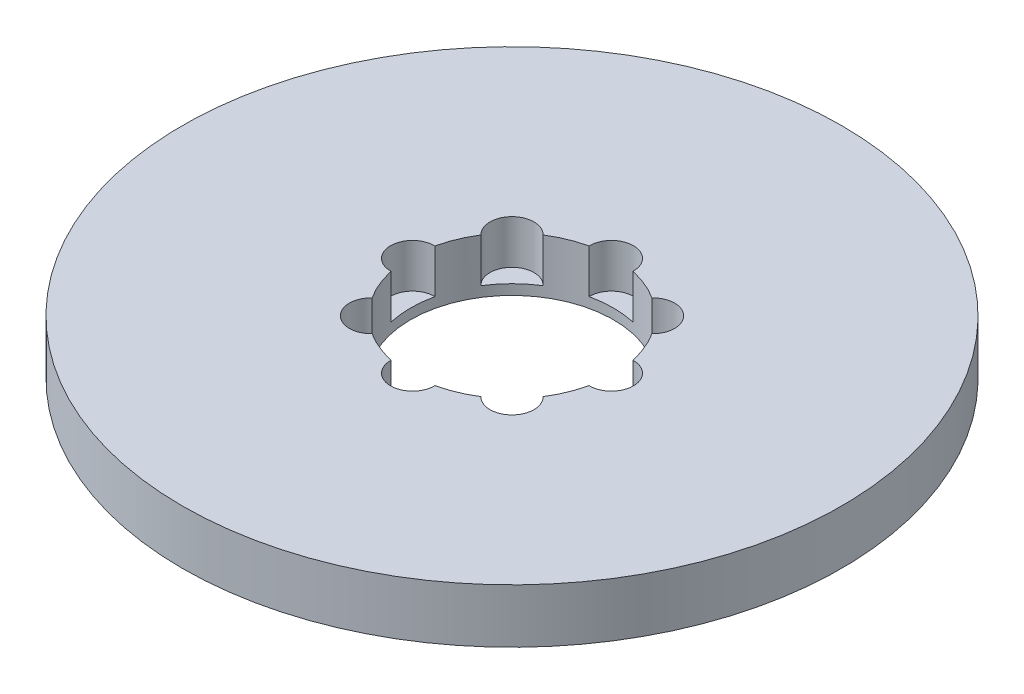
ISO-10303-21;
HEADER;
FILE_DESCRIPTION(('STEP AP214'),'2;1');
FILE_NAME('part.step','',(''),(''),'','','');
FILE_SCHEMA(('AUTOMOTIVE_DESIGN { 1 0 10303 214 1 1 1 1 }'));
ENDSEC;
DATA;
#1=APPLICATION_CONTEXT('core data for automotive mechanical design processes');
#2=APPLICATION_PROTOCOL_DEFINITION('international standard','automotive_design',2000,#1);
#3=PRODUCT_CONTEXT('',#1,'mechanical');
#4=PRODUCT('Part','Part','',(#3));
#5=PRODUCT_RELATED_PRODUCT_CATEGORY('part','',(#4));
#6=PRODUCT_DEFINITION_FORMATION('','',#4);
#7=PRODUCT_DEFINITION_CONTEXT('part definition',#1,'design');
#8=PRODUCT_DEFINITION('design','',#6,#7);
#9=PRODUCT_DEFINITION_SHAPE('','',#8);
#10=(LENGTH_UNIT() NAMED_UNIT(*) SI_UNIT(.MILLI.,.METRE.));
#11=(NAMED_UNIT(*) PLANE_ANGLE_UNIT() SI_UNIT($,.RADIAN.));
#12=(NAMED_UNIT(*) SI_UNIT($,.STERADIAN.) SOLID_ANGLE_UNIT());
#13=UNCERTAINTY_MEASURE_WITH_UNIT(LENGTH_MEASURE(1.E-05),#10,'distance_accuracy_value','');
#14=(GEOMETRIC_REPRESENTATION_CONTEXT(3) GLOBAL_UNCERTAINTY_ASSIGNED_CONTEXT((#13)) GLOBAL_UNIT_ASSIGNED_CONTEXT((#10,
#11,#12)) REPRESENTATION_CONTEXT('',''));
#15=CARTESIAN_POINT('',(0.,0.,0.));
#16=DIRECTION('',(0.,0.,1.));
#17=DIRECTION('',(1.,0.,0.));
#18=AXIS2_PLACEMENT_3D('',#15,#16,#17);
#19=CARTESIAN_POINT('',(0.,16.,0.));
#20=DIRECTION('',(0.,-1.,0.));
#21=DIRECTION('',(0.,0.,-1.));
#22=AXIS2_PLACEMENT_3D('',#19,#20,#21);
#23=CYLINDRICAL_SURFACE('',#22,97.5);
#24=CARTESIAN_POINT('',(0.,16.,0.));
#25=DIRECTION('',(0.,1.,0.));
#26=DIRECTION('',(0.,0.,1.));
#27=AXIS2_PLACEMENT_3D('',#24,#25,#26);
#28=CIRCLE('',#27,97.5);
#29=CARTESIAN_POINT('',(0.,16.,97.5));
#30=VERTEX_POINT('',#29);
#31=EDGE_CURVE('E195',#30,#30,#28,.T.);
#32=ORIENTED_EDGE('',*,*,#31,.F.);
#33=EDGE_LOOP('',(#32));
#34=FACE_BOUND('',#33,.T.);
#35=CARTESIAN_POINT('',(0.,0.,0.));
#36=DIRECTION('',(0.,1.,0.));
#37=DIRECTION('',(0.,0.,1.));
#38=AXIS2_PLACEMENT_3D('',#35,#36,#37);
#39=CIRCLE('',#38,97.5);
#40=CARTESIAN_POINT('',(0.,0.,97.5));
#41=VERTEX_POINT('',#40);
#42=EDGE_CURVE('E179',#41,#41,#39,.T.);
#43=ORIENTED_EDGE('',*,*,#42,.T.);
#44=EDGE_LOOP('',(#43));
#45=FACE_BOUND('',#44,.T.);
#46=ADVANCED_FACE('F39',(#34,#45),#23,.T.);
#47=CARTESIAN_POINT('',(0.,16.,0.));
#48=DIRECTION('',(0.,1.,0.));
#49=DIRECTION('',(0.,0.,1.));
#50=AXIS2_PLACEMENT_3D('',#47,#48,#49);
#51=PLANE('',#50);
#52=CARTESIAN_POINT('',(1.02750242661465E-13,16.,29.4288391343688));
#53=DIRECTION('',(0.,1.,0.));
#54=DIRECTION('',(1.,0.,0.));
#55=AXIS2_PLACEMENT_3D('',#52,#53,#54);
#56=CIRCLE('',#55,6.49763676903849);
#57=CARTESIAN_POINT('',(-6.49611522311852,16.,29.2882312031295));
#58=VERTEX_POINT('',#57);
#59=CARTESIAN_POINT('',(6.49611522311872,16.,29.2882312031294));
#60=VERTEX_POINT('',#59);
#61=EDGE_CURVE('E176',#58,#60,#56,.T.);
#62=ORIENTED_EDGE('',*,*,#61,.F.);
#63=CARTESIAN_POINT('',(0.,16.,0.));
#64=DIRECTION('',(0.,1.,0.));
#65=DIRECTION('',(0.,0.,1.));
#66=AXIS2_PLACEMENT_3D('',#63,#64,#65);
#67=CIRCLE('',#66,30.);
#68=CARTESIAN_POINT('',(-16.1164597670559,16.,25.3033540183286));
#69=VERTEX_POINT('',#68);
#70=EDGE_CURVE('E166',#69,#58,#67,.T.);
#71=ORIENTED_EDGE('',*,*,#70,.F.);
#72=CARTESIAN_POINT('',(-20.8093317143602,16.,20.8093317143602));
#73=DIRECTION('',(0.,1.,0.));
#74=DIRECTION('',(0.707106781186549,0.,0.707106781186546));
#75=AXIS2_PLACEMENT_3D('',#72,#73,#74);
#76=CIRCLE('',#75,6.49763676903849);
#77=CARTESIAN_POINT('',(-25.3033540183286,16.,16.116459767056));
#78=VERTEX_POINT('',#77);
#79=EDGE_CURVE('E147',#78,#69,#76,.T.);
#80=ORIENTED_EDGE('',*,*,#79,.F.);
#81=CARTESIAN_POINT('',(-29.2882312031295,16.,6.49611522311862));
#82=VERTEX_POINT('',#81);
#83=EDGE_CURVE('E180',#82,#78,#67,.T.);
#84=ORIENTED_EDGE('',*,*,#83,.F.);
#85=CARTESIAN_POINT('',(-29.4288391343688,16.,0.));
#86=DIRECTION('',(0.,1.,0.));
#87=DIRECTION('',(0.,0.,1.));
#88=AXIS2_PLACEMENT_3D('',#85,#86,#87);
#89=CIRCLE('',#88,6.49763676903849);
#90=CARTESIAN_POINT('',(-29.2882312031295,16.,-6.49611522311862));
#91=VERTEX_POINT('',#90);
#92=EDGE_CURVE('E186',#91,#82,#89,.T.);
#93=ORIENTED_EDGE('',*,*,#92,.F.);
#94=CARTESIAN_POINT('',(-25.3033540183288,16.,-16.1164597670556));
#95=VERTEX_POINT('',#94);
#96=EDGE_CURVE('E182',#95,#91,#67,.T.);
#97=ORIENTED_EDGE('',*,*,#96,.F.);
#98=CARTESIAN_POINT('',(-20.8093317143605,16.,-20.8093317143599));
#99=DIRECTION('',(0.,1.,0.));
#100=DIRECTION('',(-0.707106781186539,0.,0.707106781186556));
#101=AXIS2_PLACEMENT_3D('',#98,#99,#100);
#102=CIRCLE('',#101,6.49763676903849);
#103=CARTESIAN_POINT('',(-16.1164597670562,16.,-25.3033540183284));
#104=VERTEX_POINT('',#103);
#105=EDGE_CURVE('E446',#104,#95,#102,.T.);
#106=ORIENTED_EDGE('',*,*,#105,.F.);
#107=CARTESIAN_POINT('',(-6.49611522311893,16.,-29.2882312031294));
#108=VERTEX_POINT('',#107);
#109=EDGE_CURVE('E452',#108,#104,#67,.T.);
#110=ORIENTED_EDGE('',*,*,#109,.F.);
#111=CARTESIAN_POINT('',(-3.08250727984395E-13,16.,-29.4288391343688));
#112=DIRECTION('',(0.,1.,0.));
#113=DIRECTION('',(-1.,0.,0.));
#114=AXIS2_PLACEMENT_3D('',#111,#112,#113);
#115=CIRCLE('',#114,6.49763676903849);
#116=CARTESIAN_POINT('',(6.49611522311832,16.,-29.2882312031295));
#117=VERTEX_POINT('',#116);
#118=EDGE_CURVE('E477',#117,#108,#115,.T.);
#119=ORIENTED_EDGE('',*,*,#118,.F.);
#120=CARTESIAN_POINT('',(16.1164597670557,16.,-25.3033540183288));
#121=VERTEX_POINT('',#120);
#122=EDGE_CURVE('E460',#121,#117,#67,.T.);
#123=ORIENTED_EDGE('',*,*,#122,.F.);
#124=CARTESIAN_POINT('',(20.80933171436,16.,-20.8093317143604));
#125=DIRECTION('',(0.,1.,0.));
#126=DIRECTION('',(-0.707106781186554,0.,-0.707106781186541));
#127=AXIS2_PLACEMENT_3D('',#124,#125,#126);
#128=CIRCLE('',#127,6.49763676903849);
#129=CARTESIAN_POINT('',(25.3033540183285,16.,-16.1164597670562));
#130=VERTEX_POINT('',#129);
#131=EDGE_CURVE('E464',#130,#121,#128,.T.);
#132=ORIENTED_EDGE('',*,*,#131,.F.);
#133=CARTESIAN_POINT('',(29.2882312031295,16.,-6.49611522311862));
#134=VERTEX_POINT('',#133);
#135=EDGE_CURVE('E459',#134,#130,#67,.T.);
#136=ORIENTED_EDGE('',*,*,#135,.F.);
#137=CARTESIAN_POINT('',(29.4288391343688,16.,0.));
#138=DIRECTION('',(0.,1.,0.));
#139=DIRECTION('',(0.,0.,-1.));
#140=AXIS2_PLACEMENT_3D('',#137,#138,#139);
#141=CIRCLE('',#140,6.49763676903849);
#142=CARTESIAN_POINT('',(29.2882312031295,16.,6.49611522311862));
#143=VERTEX_POINT('',#142);
#144=EDGE_CURVE('E469',#143,#134,#141,.T.);
#145=ORIENTED_EDGE('',*,*,#144,.F.);
#146=CARTESIAN_POINT('',(25.3033540183287,16.,16.1164597670558));
#147=VERTEX_POINT('',#146);
#148=EDGE_CURVE('E181',#147,#143,#67,.T.);
#149=ORIENTED_EDGE('',*,*,#148,.F.);
#150=CARTESIAN_POINT('',(20.8093317143603,16.,20.8093317143601));
#151=DIRECTION('',(0.,1.,0.));
#152=DIRECTION('',(0.707106781186544,0.,-0.707106781186551));
#153=AXIS2_PLACEMENT_3D('',#150,#151,#152);
#154=CIRCLE('',#153,6.49763676903849);
#155=CARTESIAN_POINT('',(16.1164597670561,16.,25.3033540183285));
#156=VERTEX_POINT('',#155);
#157=EDGE_CURVE('E475',#156,#147,#154,.T.);
#158=ORIENTED_EDGE('',*,*,#157,.F.);
#159=EDGE_CURVE('E177',#60,#156,#67,.T.);
#160=ORIENTED_EDGE('',*,*,#159,.F.);
#161=EDGE_LOOP('',(#62,#71,#80,#84,#93,#97,#106,#110,#119,#123,#132,#136,#145,#149,#158,#160));
#162=FACE_BOUND('',#161,.T.);
#163=ORIENTED_EDGE('',*,*,#31,.T.);
#164=EDGE_LOOP('',(#163));
#165=FACE_BOUND('',#164,.T.);
#166=ADVANCED_FACE('F172',(#162,#165),#51,.T.);
#167=CARTESIAN_POINT('',(0.,0.,0.));
#168=DIRECTION('',(0.,1.,0.));
#169=DIRECTION('',(0.,0.,1.));
#170=AXIS2_PLACEMENT_3D('',#167,#168,#169);
#171=PLANE('',#170);
#172=CARTESIAN_POINT('',(0.,0.,0.));
#173=DIRECTION('',(0.,1.,0.));
#174=DIRECTION('',(0.,0.,1.));
#175=AXIS2_PLACEMENT_3D('',#172,#173,#174);
#176=CIRCLE('',#175,30.);
#177=CARTESIAN_POINT('',(0.,0.,30.));
#178=VERTEX_POINT('',#177);
#179=EDGE_CURVE('E187',#178,#178,#176,.T.);
#180=ORIENTED_EDGE('',*,*,#179,.T.);
#181=EDGE_LOOP('',(#180));
#182=FACE_BOUND('',#181,.T.);
#183=ORIENTED_EDGE('',*,*,#42,.F.);
#184=EDGE_LOOP('',(#183));
#185=FACE_BOUND('',#184,.T.);
#186=ADVANCED_FACE('F270',(#182,#185),#171,.F.);
#187=CARTESIAN_POINT('',(0.,16.,0.));
#188=DIRECTION('',(0.,-1.,0.));
#189=DIRECTION('',(0.,0.,-1.));
#190=AXIS2_PLACEMENT_3D('',#187,#188,#189);
#191=CYLINDRICAL_SURFACE('',#190,30.);
#192=DIRECTION('',(0.,1.,0.));
#193=VECTOR('',#192,1.);
#194=CARTESIAN_POINT('',(-6.49611522311852,9.50740848919662,29.2882312031295));
#195=LINE('',#194,#193);
#196=CARTESIAN_POINT('',(-6.49611522311852,3.01481697839323,29.2882312031295));
#197=VERTEX_POINT('',#196);
#198=EDGE_CURVE('E11',#197,#58,#195,.T.);
#199=ORIENTED_EDGE('',*,*,#198,.F.);
#200=CARTESIAN_POINT('',(0.,3.01481697839323,0.));
#201=DIRECTION('',(0.,1.,0.));
#202=DIRECTION('',(0.,0.,1.));
#203=AXIS2_PLACEMENT_3D('',#200,#201,#202);
#204=CIRCLE('',#203,30.);
#205=CARTESIAN_POINT('',(6.49611522311872,3.01481697839323,29.2882312031294));
#206=VERTEX_POINT('',#205);
#207=EDGE_CURVE('E250',#197,#206,#204,.T.);
#208=ORIENTED_EDGE('',*,*,#207,.T.);
#209=DIRECTION('',(0.,1.,0.));
#210=VECTOR('',#209,1.);
#211=CARTESIAN_POINT('',(6.49611522311872,9.50740848919662,29.2882312031294));
#212=LINE('',#211,#210);
#213=EDGE_CURVE('E46',#60,#206,#212,.F.);
#214=ORIENTED_EDGE('',*,*,#213,.F.);
#215=ORIENTED_EDGE('',*,*,#159,.T.);
#216=DIRECTION('',(0.,1.,0.));
#217=VECTOR('',#216,1.);
#218=CARTESIAN_POINT('',(16.1164597670561,9.50740848919662,25.3033540183285));
#219=LINE('',#218,#217);
#220=CARTESIAN_POINT('',(16.1164597670561,3.01481697839323,25.3033540183285));
#221=VERTEX_POINT('',#220);
#222=EDGE_CURVE('E244',#221,#156,#219,.T.);
#223=ORIENTED_EDGE('',*,*,#222,.F.);
#224=CARTESIAN_POINT('',(0.,3.01481697839323,0.));
#225=DIRECTION('',(0.,1.,0.));
#226=DIRECTION('',(0.,0.,1.));
#227=AXIS2_PLACEMENT_3D('',#224,#225,#226);
#228=CIRCLE('',#227,30.);
#229=CARTESIAN_POINT('',(25.3033540183287,3.01481697839323,16.1164597670558));
#230=VERTEX_POINT('',#229);
#231=EDGE_CURVE('E238',#221,#230,#228,.T.);
#232=ORIENTED_EDGE('',*,*,#231,.T.);
#233=DIRECTION('',(0.,1.,0.));
#234=VECTOR('',#233,1.);
#235=CARTESIAN_POINT('',(25.3033540183287,9.50740848919662,16.1164597670558));
#236=LINE('',#235,#234);
#237=EDGE_CURVE('E242',#147,#230,#236,.F.);
#238=ORIENTED_EDGE('',*,*,#237,.F.);
#239=ORIENTED_EDGE('',*,*,#148,.T.);
#240=DIRECTION('',(0.,1.,0.));
#241=VECTOR('',#240,1.);
#242=CARTESIAN_POINT('',(29.2882312031295,9.50740848919662,6.49611522311862));
#243=LINE('',#242,#241);
#244=CARTESIAN_POINT('',(29.2882312031295,3.01481697839323,6.49611522311862));
#245=VERTEX_POINT('',#244);
#246=EDGE_CURVE('E236',#245,#143,#243,.T.);
#247=ORIENTED_EDGE('',*,*,#246,.F.);
#248=CARTESIAN_POINT('',(0.,3.01481697839323,0.));
#249=DIRECTION('',(0.,1.,0.));
#250=DIRECTION('',(0.,0.,1.));
#251=AXIS2_PLACEMENT_3D('',#248,#249,#250);
#252=CIRCLE('',#251,30.);
#253=CARTESIAN_POINT('',(29.2882312031295,3.01481697839323,-6.49611522311862));
#254=VERTEX_POINT('',#253);
#255=EDGE_CURVE('E235',#245,#254,#252,.T.);
#256=ORIENTED_EDGE('',*,*,#255,.T.);
#257=DIRECTION('',(0.,1.,0.));
#258=VECTOR('',#257,1.);
#259=CARTESIAN_POINT('',(29.2882312031295,9.50740848919662,-6.49611522311862));
#260=LINE('',#259,#258);
#261=EDGE_CURVE('E234',#134,#254,#260,.F.);
#262=ORIENTED_EDGE('',*,*,#261,.F.);
#263=ORIENTED_EDGE('',*,*,#135,.T.);
#264=DIRECTION('',(0.,1.,0.));
#265=VECTOR('',#264,1.);
#266=CARTESIAN_POINT('',(25.3033540183285,9.50740848919662,-16.1164597670562));
#267=LINE('',#266,#265);
#268=CARTESIAN_POINT('',(25.3033540183285,3.01481697839323,-16.1164597670562));
#269=VERTEX_POINT('',#268);
#270=EDGE_CURVE('E229',#269,#130,#267,.T.);
#271=ORIENTED_EDGE('',*,*,#270,.F.);
#272=CARTESIAN_POINT('',(0.,3.01481697839323,0.));
#273=DIRECTION('',(0.,1.,0.));
#274=DIRECTION('',(0.,0.,1.));
#275=AXIS2_PLACEMENT_3D('',#272,#273,#274);
#276=CIRCLE('',#275,30.);
#277=CARTESIAN_POINT('',(16.1164597670557,3.01481697839323,-25.3033540183288));
#278=VERTEX_POINT('',#277);
#279=EDGE_CURVE('E221',#269,#278,#276,.T.);
#280=ORIENTED_EDGE('',*,*,#279,.T.);
#281=DIRECTION('',(0.,1.,0.));
#282=VECTOR('',#281,1.);
#283=CARTESIAN_POINT('',(16.1164597670557,9.50740848919662,-25.3033540183288));
#284=LINE('',#283,#282);
#285=EDGE_CURVE('E230',#121,#278,#284,.F.);
#286=ORIENTED_EDGE('',*,*,#285,.F.);
#287=ORIENTED_EDGE('',*,*,#122,.T.);
#288=DIRECTION('',(0.,1.,0.));
#289=VECTOR('',#288,1.);
#290=CARTESIAN_POINT('',(6.49611522311832,9.50740848919662,-29.2882312031295));
#291=LINE('',#290,#289);
#292=CARTESIAN_POINT('',(6.49611522311832,3.01481697839323,-29.2882312031295));
#293=VERTEX_POINT('',#292);
#294=EDGE_CURVE('E225',#293,#117,#291,.T.);
#295=ORIENTED_EDGE('',*,*,#294,.F.);
#296=CARTESIAN_POINT('',(0.,3.01481697839323,0.));
#297=DIRECTION('',(0.,1.,0.));
#298=DIRECTION('',(0.,0.,1.));
#299=AXIS2_PLACEMENT_3D('',#296,#297,#298);
#300=CIRCLE('',#299,30.);
#301=CARTESIAN_POINT('',(-6.49611522311893,3.01481697839323,-29.2882312031294));
#302=VERTEX_POINT('',#301);
#303=EDGE_CURVE('E216',#293,#302,#300,.T.);
#304=ORIENTED_EDGE('',*,*,#303,.T.);
#305=DIRECTION('',(0.,1.,0.));
#306=VECTOR('',#305,1.);
#307=CARTESIAN_POINT('',(-6.49611522311893,9.50740848919662,-29.2882312031294));
#308=LINE('',#307,#306);
#309=EDGE_CURVE('E218',#108,#302,#308,.F.);
#310=ORIENTED_EDGE('',*,*,#309,.F.);
#311=ORIENTED_EDGE('',*,*,#109,.T.);
#312=DIRECTION('',(0.,1.,0.));
#313=VECTOR('',#312,1.);
#314=CARTESIAN_POINT('',(-16.1164597670562,9.50740848919662,-25.3033540183284));
#315=LINE('',#314,#313);
#316=CARTESIAN_POINT('',(-16.1164597670562,3.01481697839323,-25.3033540183284));
#317=VERTEX_POINT('',#316);
#318=EDGE_CURVE('E212',#317,#104,#315,.T.);
#319=ORIENTED_EDGE('',*,*,#318,.F.);
#320=CARTESIAN_POINT('',(0.,3.01481697839323,0.));
#321=DIRECTION('',(0.,1.,0.));
#322=DIRECTION('',(0.,0.,1.));
#323=AXIS2_PLACEMENT_3D('',#320,#321,#322);
#324=CIRCLE('',#323,30.);
#325=CARTESIAN_POINT('',(-25.3033540183288,3.01481697839323,-16.1164597670556));
#326=VERTEX_POINT('',#325);
#327=EDGE_CURVE('E208',#317,#326,#324,.T.);
#328=ORIENTED_EDGE('',*,*,#327,.T.);
#329=DIRECTION('',(0.,1.,0.));
#330=VECTOR('',#329,1.);
#331=CARTESIAN_POINT('',(-25.3033540183288,9.50740848919662,-16.1164597670556));
#332=LINE('',#331,#330);
#333=EDGE_CURVE('E211',#95,#326,#332,.F.);
#334=ORIENTED_EDGE('',*,*,#333,.F.);
#335=ORIENTED_EDGE('',*,*,#96,.T.);
#336=DIRECTION('',(0.,1.,0.));
#337=VECTOR('',#336,1.);
#338=CARTESIAN_POINT('',(-29.2882312031295,9.50740848919662,-6.49611522311862));
#339=LINE('',#338,#337);
#340=CARTESIAN_POINT('',(-29.2882312031295,3.01481697839323,-6.49611522311862));
#341=VERTEX_POINT('',#340);
#342=EDGE_CURVE('E201',#341,#91,#339,.T.);
#343=ORIENTED_EDGE('',*,*,#342,.F.);
#344=CARTESIAN_POINT('',(0.,3.01481697839323,0.));
#345=DIRECTION('',(0.,1.,0.));
#346=DIRECTION('',(0.,0.,1.));
#347=AXIS2_PLACEMENT_3D('',#344,#345,#346);
#348=CIRCLE('',#347,30.);
#349=CARTESIAN_POINT('',(-29.2882312031295,3.01481697839323,6.49611522311862));
#350=VERTEX_POINT('',#349);
#351=EDGE_CURVE('E194',#341,#350,#348,.T.);
#352=ORIENTED_EDGE('',*,*,#351,.T.);
#353=DIRECTION('',(0.,1.,0.));
#354=VECTOR('',#353,1.);
#355=CARTESIAN_POINT('',(-29.2882312031295,9.50740848919662,6.49611522311862));
#356=LINE('',#355,#354);
#357=EDGE_CURVE('E199',#82,#350,#356,.F.);
#358=ORIENTED_EDGE('',*,*,#357,.F.);
#359=ORIENTED_EDGE('',*,*,#83,.T.);
#360=DIRECTION('',(0.,1.,0.));
#361=VECTOR('',#360,1.);
#362=CARTESIAN_POINT('',(-25.3033540183286,9.50740848919662,16.116459767056));
#363=LINE('',#362,#361);
#364=CARTESIAN_POINT('',(-25.3033540183286,3.01481697839323,16.116459767056));
#365=VERTEX_POINT('',#364);
#366=EDGE_CURVE('E160',#365,#78,#363,.T.);
#367=ORIENTED_EDGE('',*,*,#366,.F.);
#368=CARTESIAN_POINT('',(0.,3.01481697839323,0.));
#369=DIRECTION('',(0.,1.,0.));
#370=DIRECTION('',(0.,0.,1.));
#371=AXIS2_PLACEMENT_3D('',#368,#369,#370);
#372=CIRCLE('',#371,30.);
#373=CARTESIAN_POINT('',(-16.1164597670559,3.01481697839323,25.3033540183286));
#374=VERTEX_POINT('',#373);
#375=EDGE_CURVE('E168',#365,#374,#372,.T.);
#376=ORIENTED_EDGE('',*,*,#375,.T.);
#377=DIRECTION('',(0.,1.,0.));
#378=VECTOR('',#377,1.);
#379=CARTESIAN_POINT('',(-16.1164597670559,9.50740848919662,25.3033540183286));
#380=LINE('',#379,#378);
#381=EDGE_CURVE('E152',#69,#374,#380,.F.);
#382=ORIENTED_EDGE('',*,*,#381,.F.);
#383=ORIENTED_EDGE('',*,*,#70,.T.);
#384=EDGE_LOOP('',(#199,#208,#214,#215,#223,#232,#238,#239,#247,#256,#262,#263,#271,#280,#286,
#287,#295,#304,#310,#311,#319,#328,#334,#335,#343,#352,#358,#359,#367,#376,#382,#383));
#385=FACE_BOUND('',#384,.T.);
#386=ORIENTED_EDGE('',*,*,#179,.F.);
#387=EDGE_LOOP('',(#386));
#388=FACE_BOUND('',#387,.T.);
#389=ADVANCED_FACE('F170',(#385,#388),#191,.F.);
#390=CARTESIAN_POINT('',(-29.4288391343688,3.01481697839323,0.));
#391=DIRECTION('',(0.,1.,0.));
#392=DIRECTION('',(0.,0.,1.));
#393=AXIS2_PLACEMENT_3D('',#390,#391,#392);
#394=CYLINDRICAL_SURFACE('',#393,6.49763676903849);
#395=ORIENTED_EDGE('',*,*,#342,.T.);
#396=ORIENTED_EDGE('',*,*,#92,.T.);
#397=ORIENTED_EDGE('',*,*,#357,.T.);
#398=CARTESIAN_POINT('',(-29.4288391343688,3.01481697839323,0.));
#399=DIRECTION('',(0.,1.,0.));
#400=DIRECTION('',(0.,0.,1.));
#401=AXIS2_PLACEMENT_3D('',#398,#399,#400);
#402=CIRCLE('',#401,6.49763676903849);
#403=EDGE_CURVE('E191',#341,#350,#402,.T.);
#404=ORIENTED_EDGE('',*,*,#403,.F.);
#405=EDGE_LOOP('',(#395,#396,#397,#404));
#406=FACE_BOUND('',#405,.T.);
#407=ADVANCED_FACE('F279',(#406),#394,.F.);
#408=CARTESIAN_POINT('',(-29.4288391343688,3.01481697839323,0.));
#409=DIRECTION('',(0.,1.,0.));
#410=DIRECTION('',(0.,0.,1.));
#411=AXIS2_PLACEMENT_3D('',#408,#409,#410);
#412=PLANE('',#411);
#413=ORIENTED_EDGE('',*,*,#403,.T.);
#414=ORIENTED_EDGE('',*,*,#351,.F.);
#415=EDGE_LOOP('',(#413,#414));
#416=FACE_BOUND('',#415,.T.);
#417=ADVANCED_FACE('F285',(#416),#412,.T.);
#418=CARTESIAN_POINT('',(-20.8093317143602,3.01481697839323,20.8093317143602));
#419=DIRECTION('',(0.,1.,0.));
#420=DIRECTION('',(0.,0.,1.));
#421=AXIS2_PLACEMENT_3D('',#418,#419,#420);
#422=CYLINDRICAL_SURFACE('',#421,6.49763676903849);
#423=ORIENTED_EDGE('',*,*,#366,.T.);
#424=ORIENTED_EDGE('',*,*,#79,.T.);
#425=ORIENTED_EDGE('',*,*,#381,.T.);
#426=CARTESIAN_POINT('',(-20.8093317143602,3.01481697839323,20.8093317143602));
#427=DIRECTION('',(0.,1.,0.));
#428=DIRECTION('',(0.707106781186549,0.,0.707106781186546));
#429=AXIS2_PLACEMENT_3D('',#426,#427,#428);
#430=CIRCLE('',#429,6.49763676903849);
#431=EDGE_CURVE('E165',#365,#374,#430,.T.);
#432=ORIENTED_EDGE('',*,*,#431,.F.);
#433=EDGE_LOOP('',(#423,#424,#425,#432));
#434=FACE_BOUND('',#433,.T.);
#435=ADVANCED_FACE('F155',(#434),#422,.F.);
#436=CARTESIAN_POINT('',(-20.8093317143602,3.01481697839323,20.8093317143602));
#437=DIRECTION('',(0.,1.,0.));
#438=DIRECTION('',(0.707106781186549,0.,0.707106781186546));
#439=AXIS2_PLACEMENT_3D('',#436,#437,#438);
#440=PLANE('',#439);
#441=ORIENTED_EDGE('',*,*,#431,.T.);
#442=ORIENTED_EDGE('',*,*,#375,.F.);
#443=EDGE_LOOP('',(#441,#442));
#444=FACE_BOUND('',#443,.T.);
#445=ADVANCED_FACE('F288',(#444),#440,.T.);
#446=CARTESIAN_POINT('',(-20.8093317143605,3.01481697839323,-20.8093317143599));
#447=DIRECTION('',(0.,1.,0.));
#448=DIRECTION('',(0.,0.,1.));
#449=AXIS2_PLACEMENT_3D('',#446,#447,#448);
#450=CYLINDRICAL_SURFACE('',#449,6.49763676903849);
#451=ORIENTED_EDGE('',*,*,#318,.T.);
#452=ORIENTED_EDGE('',*,*,#105,.T.);
#453=ORIENTED_EDGE('',*,*,#333,.T.);
#454=CARTESIAN_POINT('',(-20.8093317143605,3.01481697839323,-20.8093317143599));
#455=DIRECTION('',(0.,1.,0.));
#456=DIRECTION('',(-0.707106781186539,0.,0.707106781186556));
#457=AXIS2_PLACEMENT_3D('',#454,#455,#456);
#458=CIRCLE('',#457,6.49763676903849);
#459=EDGE_CURVE('E447',#317,#326,#458,.T.);
#460=ORIENTED_EDGE('',*,*,#459,.F.);
#461=EDGE_LOOP('',(#451,#452,#453,#460));
#462=FACE_BOUND('',#461,.T.);
#463=ADVANCED_FACE('F295',(#462),#450,.F.);
#464=CARTESIAN_POINT('',(-20.8093317143605,3.01481697839323,-20.8093317143599));
#465=DIRECTION('',(0.,1.,0.));
#466=DIRECTION('',(-0.707106781186539,0.,0.707106781186556));
#467=AXIS2_PLACEMENT_3D('',#464,#465,#466);
#468=PLANE('',#467);
#469=ORIENTED_EDGE('',*,*,#459,.T.);
#470=ORIENTED_EDGE('',*,*,#327,.F.);
#471=EDGE_LOOP('',(#469,#470));
#472=FACE_BOUND('',#471,.T.);
#473=ADVANCED_FACE('F375',(#472),#468,.T.);
#474=CARTESIAN_POINT('',(-3.08250727984395E-13,3.01481697839323,-29.4288391343688));
#475=DIRECTION('',(0.,1.,0.));
#476=DIRECTION('',(0.,0.,1.));
#477=AXIS2_PLACEMENT_3D('',#474,#475,#476);
#478=CYLINDRICAL_SURFACE('',#477,6.49763676903849);
#479=ORIENTED_EDGE('',*,*,#294,.T.);
#480=ORIENTED_EDGE('',*,*,#118,.T.);
#481=ORIENTED_EDGE('',*,*,#309,.T.);
#482=CARTESIAN_POINT('',(-3.08250727984395E-13,3.01481697839323,-29.4288391343688));
#483=DIRECTION('',(0.,1.,0.));
#484=DIRECTION('',(-1.,0.,0.));
#485=AXIS2_PLACEMENT_3D('',#482,#483,#484);
#486=CIRCLE('',#485,6.49763676903849);
#487=EDGE_CURVE('E467',#293,#302,#486,.T.);
#488=ORIENTED_EDGE('',*,*,#487,.F.);
#489=EDGE_LOOP('',(#479,#480,#481,#488));
#490=FACE_BOUND('',#489,.T.);
#491=ADVANCED_FACE('F361',(#490),#478,.F.);
#492=CARTESIAN_POINT('',(-3.08250727984395E-13,3.01481697839323,-29.4288391343688));
#493=DIRECTION('',(0.,1.,0.));
#494=DIRECTION('',(-1.,0.,0.));
#495=AXIS2_PLACEMENT_3D('',#492,#493,#494);
#496=PLANE('',#495);
#497=ORIENTED_EDGE('',*,*,#487,.T.);
#498=ORIENTED_EDGE('',*,*,#303,.F.);
#499=EDGE_LOOP('',(#497,#498));
#500=FACE_BOUND('',#499,.T.);
#501=ADVANCED_FACE('F297',(#500),#496,.T.);
#502=CARTESIAN_POINT('',(20.80933171436,3.01481697839323,-20.8093317143604));
#503=DIRECTION('',(0.,1.,0.));
#504=DIRECTION('',(0.,0.,1.));
#505=AXIS2_PLACEMENT_3D('',#502,#503,#504);
#506=CYLINDRICAL_SURFACE('',#505,6.49763676903849);
#507=ORIENTED_EDGE('',*,*,#270,.T.);
#508=ORIENTED_EDGE('',*,*,#131,.T.);
#509=ORIENTED_EDGE('',*,*,#285,.T.);
#510=CARTESIAN_POINT('',(20.80933171436,3.01481697839323,-20.8093317143604));
#511=DIRECTION('',(0.,1.,0.));
#512=DIRECTION('',(-0.707106781186554,0.,-0.707106781186541));
#513=AXIS2_PLACEMENT_3D('',#510,#511,#512);
#514=CIRCLE('',#513,6.49763676903849);
#515=EDGE_CURVE('E470',#269,#278,#514,.T.);
#516=ORIENTED_EDGE('',*,*,#515,.F.);
#517=EDGE_LOOP('',(#507,#508,#509,#516));
#518=FACE_BOUND('',#517,.T.);
#519=ADVANCED_FACE('F294',(#518),#506,.F.);
#520=CARTESIAN_POINT('',(20.80933171436,3.01481697839323,-20.8093317143604));
#521=DIRECTION('',(0.,1.,0.));
#522=DIRECTION('',(-0.707106781186554,0.,-0.707106781186541));
#523=AXIS2_PLACEMENT_3D('',#520,#521,#522);
#524=PLANE('',#523);
#525=ORIENTED_EDGE('',*,*,#515,.T.);
#526=ORIENTED_EDGE('',*,*,#279,.F.);
#527=EDGE_LOOP('',(#525,#526));
#528=FACE_BOUND('',#527,.T.);
#529=ADVANCED_FACE('F300',(#528),#524,.T.);
#530=CARTESIAN_POINT('',(29.4288391343688,3.01481697839323,0.));
#531=DIRECTION('',(0.,1.,0.));
#532=DIRECTION('',(0.,0.,1.));
#533=AXIS2_PLACEMENT_3D('',#530,#531,#532);
#534=CYLINDRICAL_SURFACE('',#533,6.49763676903849);
#535=ORIENTED_EDGE('',*,*,#246,.T.);
#536=ORIENTED_EDGE('',*,*,#144,.T.);
#537=ORIENTED_EDGE('',*,*,#261,.T.);
#538=CARTESIAN_POINT('',(29.4288391343688,3.01481697839323,0.));
#539=DIRECTION('',(0.,1.,0.));
#540=DIRECTION('',(0.,0.,-1.));
#541=AXIS2_PLACEMENT_3D('',#538,#539,#540);
#542=CIRCLE('',#541,6.49763676903849);
#543=EDGE_CURVE('E472',#245,#254,#542,.T.);
#544=ORIENTED_EDGE('',*,*,#543,.F.);
#545=EDGE_LOOP('',(#535,#536,#537,#544));
#546=FACE_BOUND('',#545,.T.);
#547=ADVANCED_FACE('F305',(#546),#534,.F.);
#548=CARTESIAN_POINT('',(29.4288391343688,3.01481697839323,0.));
#549=DIRECTION('',(0.,1.,0.));
#550=DIRECTION('',(0.,0.,-1.));
#551=AXIS2_PLACEMENT_3D('',#548,#549,#550);
#552=PLANE('',#551);
#553=ORIENTED_EDGE('',*,*,#543,.T.);
#554=ORIENTED_EDGE('',*,*,#255,.F.);
#555=EDGE_LOOP('',(#553,#554));
#556=FACE_BOUND('',#555,.T.);
#557=ADVANCED_FACE('F308',(#556),#552,.T.);
#558=CARTESIAN_POINT('',(20.8093317143603,3.01481697839323,20.8093317143601));
#559=DIRECTION('',(0.,1.,0.));
#560=DIRECTION('',(0.,0.,1.));
#561=AXIS2_PLACEMENT_3D('',#558,#559,#560);
#562=CYLINDRICAL_SURFACE('',#561,6.49763676903849);
#563=ORIENTED_EDGE('',*,*,#222,.T.);
#564=ORIENTED_EDGE('',*,*,#157,.T.);
#565=ORIENTED_EDGE('',*,*,#237,.T.);
#566=CARTESIAN_POINT('',(20.8093317143603,3.01481697839323,20.8093317143601));
#567=DIRECTION('',(0.,1.,0.));
#568=DIRECTION('',(0.707106781186544,0.,-0.707106781186551));
#569=AXIS2_PLACEMENT_3D('',#566,#567,#568);
#570=CIRCLE('',#569,6.49763676903849);
#571=EDGE_CURVE('E56',#221,#230,#570,.T.);
#572=ORIENTED_EDGE('',*,*,#571,.F.);
#573=EDGE_LOOP('',(#563,#564,#565,#572));
#574=FACE_BOUND('',#573,.T.);
#575=ADVANCED_FACE('F309',(#574),#562,.F.);
#576=CARTESIAN_POINT('',(20.8093317143603,3.01481697839323,20.8093317143601));
#577=DIRECTION('',(0.,1.,0.));
#578=DIRECTION('',(0.707106781186544,0.,-0.707106781186551));
#579=AXIS2_PLACEMENT_3D('',#576,#577,#578);
#580=PLANE('',#579);
#581=ORIENTED_EDGE('',*,*,#571,.T.);
#582=ORIENTED_EDGE('',*,*,#231,.F.);
#583=EDGE_LOOP('',(#581,#582));
#584=FACE_BOUND('',#583,.T.);
#585=ADVANCED_FACE('F256',(#584),#580,.T.);
#586=CARTESIAN_POINT('',(1.02750242661465E-13,3.01481697839323,29.4288391343688));
#587=DIRECTION('',(0.,1.,0.));
#588=DIRECTION('',(0.,0.,1.));
#589=AXIS2_PLACEMENT_3D('',#586,#587,#588);
#590=CYLINDRICAL_SURFACE('',#589,6.49763676903849);
#591=ORIENTED_EDGE('',*,*,#198,.T.);
#592=ORIENTED_EDGE('',*,*,#61,.T.);
#593=ORIENTED_EDGE('',*,*,#213,.T.);
#594=CARTESIAN_POINT('',(1.02750242661465E-13,3.01481697839323,29.4288391343688));
#595=DIRECTION('',(0.,1.,0.));
#596=DIRECTION('',(1.,0.,0.));
#597=AXIS2_PLACEMENT_3D('',#594,#595,#596);
#598=CIRCLE('',#597,6.49763676903849);
#599=EDGE_CURVE('E55',#197,#206,#598,.T.);
#600=ORIENTED_EDGE('',*,*,#599,.F.);
#601=EDGE_LOOP('',(#591,#592,#593,#600));
#602=FACE_BOUND('',#601,.T.);
#603=ADVANCED_FACE('F253',(#602),#590,.F.);
#604=CARTESIAN_POINT('',(1.02750242661465E-13,3.01481697839323,29.4288391343688));
#605=DIRECTION('',(0.,1.,0.));
#606=DIRECTION('',(1.,0.,0.));
#607=AXIS2_PLACEMENT_3D('',#604,#605,#606);
#608=PLANE('',#607);
#609=ORIENTED_EDGE('',*,*,#599,.T.);
#610=ORIENTED_EDGE('',*,*,#207,.F.);
#611=EDGE_LOOP('',(#609,#610));
#612=FACE_BOUND('',#611,.T.);
#613=ADVANCED_FACE('F252',(#612),#608,.T.);
#614=CLOSED_SHELL('',(#46,#166,#186,#389,#407,#417,#435,#445,#463,#473,#491,#501,#519,#529,#547,
#557,#575,#585,#603,#613));
#615=MANIFOLD_SOLID_BREP('B2',#614);
#616=ADVANCED_BREP_SHAPE_REPRESENTATION('',(#18,#615),#14);
#617=SHAPE_DEFINITION_REPRESENTATION(#9,#616);
ENDSEC;
END-ISO-10303-21;
